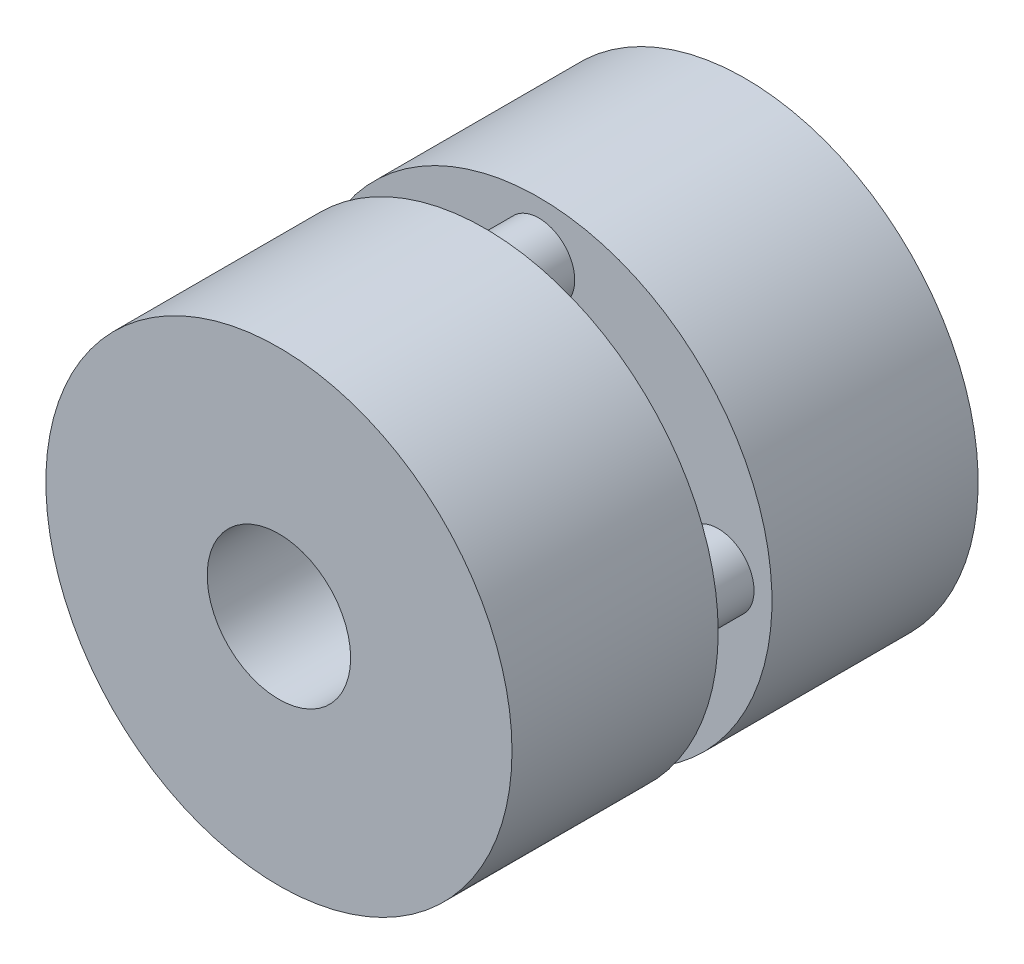
ISO-10303-21;
HEADER;
FILE_DESCRIPTION(('STEP AP214'),'2;1');
FILE_NAME('part.step','',(''),(''),'','','');
FILE_SCHEMA(('AUTOMOTIVE_DESIGN { 1 0 10303 214 1 1 1 1 }'));
ENDSEC;
DATA;
#1=APPLICATION_CONTEXT('core data for automotive mechanical design processes');
#2=APPLICATION_PROTOCOL_DEFINITION('international standard','automotive_design',2000,#1);
#3=PRODUCT_CONTEXT('',#1,'mechanical');
#4=PRODUCT('Part','Part','',(#3));
#5=PRODUCT_RELATED_PRODUCT_CATEGORY('part','',(#4));
#6=PRODUCT_DEFINITION_FORMATION('','',#4);
#7=PRODUCT_DEFINITION_CONTEXT('part definition',#1,'design');
#8=PRODUCT_DEFINITION('design','',#6,#7);
#9=PRODUCT_DEFINITION_SHAPE('','',#8);
#10=(LENGTH_UNIT() NAMED_UNIT(*) SI_UNIT(.MILLI.,.METRE.));
#11=(NAMED_UNIT(*) PLANE_ANGLE_UNIT() SI_UNIT($,.RADIAN.));
#12=(NAMED_UNIT(*) SI_UNIT($,.STERADIAN.) SOLID_ANGLE_UNIT());
#13=UNCERTAINTY_MEASURE_WITH_UNIT(LENGTH_MEASURE(1.E-05),#10,'distance_accuracy_value','');
#14=(GEOMETRIC_REPRESENTATION_CONTEXT(3) GLOBAL_UNCERTAINTY_ASSIGNED_CONTEXT((#13)) GLOBAL_UNIT_ASSIGNED_CONTEXT((#10,
#11,#12)) REPRESENTATION_CONTEXT('',''));
#15=CARTESIAN_POINT('',(0.,0.,0.));
#16=DIRECTION('',(0.,0.,1.));
#17=DIRECTION('',(1.,0.,0.));
#18=AXIS2_PLACEMENT_3D('',#15,#16,#17);
#19=CARTESIAN_POINT('',(0.,0.,11.5));
#20=DIRECTION('',(0.,0.,1.));
#21=DIRECTION('',(1.,0.,0.));
#22=AXIS2_PLACEMENT_3D('',#19,#20,#21);
#23=PLANE('',#22);
#24=CARTESIAN_POINT('',(0.,0.,11.5));
#25=DIRECTION('',(0.,0.,1.));
#26=DIRECTION('',(1.,0.,0.));
#27=AXIS2_PLACEMENT_3D('',#24,#25,#26);
#28=CIRCLE('',#27,13.);
#29=CARTESIAN_POINT('',(13.,0.,11.5));
#30=VERTEX_POINT('',#29);
#31=EDGE_CURVE('E52',#30,#30,#28,.T.);
#32=ORIENTED_EDGE('',*,*,#31,.T.);
#33=EDGE_LOOP('',(#32));
#34=FACE_BOUND('',#33,.T.);
#35=CARTESIAN_POINT('',(0.,0.,11.5));
#36=DIRECTION('',(0.,0.,1.));
#37=DIRECTION('',(1.,0.,0.));
#38=AXIS2_PLACEMENT_3D('',#35,#36,#37);
#39=CIRCLE('',#38,4.);
#40=CARTESIAN_POINT('',(4.,0.,11.5));
#41=VERTEX_POINT('',#40);
#42=EDGE_CURVE('E56',#41,#41,#39,.T.);
#43=ORIENTED_EDGE('',*,*,#42,.F.);
#44=EDGE_LOOP('',(#43));
#45=FACE_BOUND('',#44,.T.);
#46=ADVANCED_FACE('F32',(#34,#45),#23,.T.);
#47=CARTESIAN_POINT('',(0.,0.,0.));
#48=DIRECTION('',(0.,0.,1.));
#49=DIRECTION('',(1.,0.,0.));
#50=AXIS2_PLACEMENT_3D('',#47,#48,#49);
#51=PLANE('',#50);
#52=CARTESIAN_POINT('',(9.99999999999972,-2.8421709430404E-13,0.));
#53=DIRECTION('',(0.,0.,1.));
#54=DIRECTION('',(1.,0.,0.));
#55=AXIS2_PLACEMENT_3D('',#52,#53,#54);
#56=CIRCLE('',#55,2.00000000000045);
#57=CARTESIAN_POINT('',(12.0000000000002,-2.8421709430404E-13,0.));
#58=VERTEX_POINT('',#57);
#59=EDGE_CURVE('E10',#58,#58,#56,.F.);
#60=ORIENTED_EDGE('',*,*,#59,.F.);
#61=EDGE_LOOP('',(#60));
#62=FACE_BOUND('',#61,.T.);
#63=CARTESIAN_POINT('',(-5.65984895009786E-13,-10.,0.));
#64=DIRECTION('',(0.,0.,1.));
#65=DIRECTION('',(1.,0.,0.));
#66=AXIS2_PLACEMENT_3D('',#63,#64,#65);
#67=CIRCLE('',#66,2.00000000000061);
#68=CARTESIAN_POINT('',(2.00000000000004,-10.,0.));
#69=VERTEX_POINT('',#68);
#70=EDGE_CURVE('E39',#69,#69,#67,.F.);
#71=ORIENTED_EDGE('',*,*,#70,.F.);
#72=EDGE_LOOP('',(#71));
#73=FACE_BOUND('',#72,.T.);
#74=CARTESIAN_POINT('',(-10.0000000000003,2.82992447504893E-13,0.));
#75=DIRECTION('',(0.,0.,1.));
#76=DIRECTION('',(1.,0.,0.));
#77=AXIS2_PLACEMENT_3D('',#74,#75,#76);
#78=CIRCLE('',#77,2.00000000000022);
#79=CARTESIAN_POINT('',(-8.00000000000006,2.82992447504893E-13,0.));
#80=VERTEX_POINT('',#79);
#81=EDGE_CURVE('E43',#80,#80,#78,.F.);
#82=ORIENTED_EDGE('',*,*,#81,.F.);
#83=EDGE_LOOP('',(#82));
#84=FACE_BOUND('',#83,.T.);
#85=CARTESIAN_POINT('',(0.,10.,0.));
#86=DIRECTION('',(0.,0.,1.));
#87=DIRECTION('',(1.,0.,0.));
#88=AXIS2_PLACEMENT_3D('',#85,#86,#87);
#89=CIRCLE('',#88,2.);
#90=CARTESIAN_POINT('',(2.,10.,0.));
#91=VERTEX_POINT('',#90);
#92=EDGE_CURVE('E47',#91,#91,#89,.F.);
#93=ORIENTED_EDGE('',*,*,#92,.F.);
#94=EDGE_LOOP('',(#93));
#95=FACE_BOUND('',#94,.T.);
#96=CARTESIAN_POINT('',(0.,0.,0.));
#97=DIRECTION('',(0.,0.,1.));
#98=DIRECTION('',(1.,0.,0.));
#99=AXIS2_PLACEMENT_3D('',#96,#97,#98);
#100=CIRCLE('',#99,13.);
#101=CARTESIAN_POINT('',(13.,0.,0.));
#102=VERTEX_POINT('',#101);
#103=EDGE_CURVE('E53',#102,#102,#100,.T.);
#104=ORIENTED_EDGE('',*,*,#103,.F.);
#105=EDGE_LOOP('',(#104));
#106=FACE_BOUND('',#105,.T.);
#107=CARTESIAN_POINT('',(0.,0.,0.));
#108=DIRECTION('',(0.,0.,1.));
#109=DIRECTION('',(1.,0.,0.));
#110=AXIS2_PLACEMENT_3D('',#107,#108,#109);
#111=CIRCLE('',#110,4.);
#112=CARTESIAN_POINT('',(4.,0.,0.));
#113=VERTEX_POINT('',#112);
#114=EDGE_CURVE('E59',#113,#113,#111,.T.);
#115=ORIENTED_EDGE('',*,*,#114,.T.);
#116=EDGE_LOOP('',(#115));
#117=FACE_BOUND('',#116,.T.);
#118=ADVANCED_FACE('F110',(#62,#73,#84,#95,#106,#117),#51,.F.);
#119=CARTESIAN_POINT('',(0.,0.,11.5));
#120=DIRECTION('',(0.,0.,-1.));
#121=DIRECTION('',(-1.,0.,0.));
#122=AXIS2_PLACEMENT_3D('',#119,#120,#121);
#123=CYLINDRICAL_SURFACE('',#122,13.);
#124=ORIENTED_EDGE('',*,*,#31,.F.);
#125=EDGE_LOOP('',(#124));
#126=FACE_BOUND('',#125,.T.);
#127=ORIENTED_EDGE('',*,*,#103,.T.);
#128=EDGE_LOOP('',(#127));
#129=FACE_BOUND('',#128,.T.);
#130=ADVANCED_FACE('F34',(#126,#129),#123,.T.);
#131=CARTESIAN_POINT('',(0.,0.,11.5));
#132=DIRECTION('',(0.,0.,-1.));
#133=DIRECTION('',(-1.,0.,0.));
#134=AXIS2_PLACEMENT_3D('',#131,#132,#133);
#135=CYLINDRICAL_SURFACE('',#134,4.);
#136=ORIENTED_EDGE('',*,*,#42,.T.);
#137=EDGE_LOOP('',(#136));
#138=FACE_BOUND('',#137,.T.);
#139=ORIENTED_EDGE('',*,*,#114,.F.);
#140=EDGE_LOOP('',(#139));
#141=FACE_BOUND('',#140,.T.);
#142=ADVANCED_FACE('F119',(#138,#141),#135,.F.);
#143=CARTESIAN_POINT('',(0.,10.,-3.));
#144=DIRECTION('',(0.,0.,1.));
#145=DIRECTION('',(1.,0.,0.));
#146=AXIS2_PLACEMENT_3D('',#143,#144,#145);
#147=CYLINDRICAL_SURFACE('',#146,2.);
#148=CARTESIAN_POINT('',(0.,10.,-3.));
#149=DIRECTION('',(0.,0.,-1.));
#150=DIRECTION('',(-1.,0.,0.));
#151=AXIS2_PLACEMENT_3D('',#148,#149,#150);
#152=CIRCLE('',#151,2.);
#153=CARTESIAN_POINT('',(-2.,10.,-3.));
#154=VERTEX_POINT('',#153);
#155=EDGE_CURVE('E62',#154,#154,#152,.T.);
#156=ORIENTED_EDGE('',*,*,#155,.F.);
#157=EDGE_LOOP('',(#156));
#158=FACE_BOUND('',#157,.T.);
#159=ORIENTED_EDGE('',*,*,#92,.T.);
#160=EDGE_LOOP('',(#159));
#161=FACE_BOUND('',#160,.T.);
#162=ADVANCED_FACE('F122',(#158,#161),#147,.T.);
#163=CARTESIAN_POINT('',(-10.0000000000003,2.82992447504893E-13,-3.));
#164=DIRECTION('',(0.,0.,1.));
#165=DIRECTION('',(1.,0.,0.));
#166=AXIS2_PLACEMENT_3D('',#163,#164,#165);
#167=CYLINDRICAL_SURFACE('',#166,2.00000000000022);
#168=CARTESIAN_POINT('',(-10.0000000000003,2.82992447504893E-13,-3.));
#169=DIRECTION('',(0.,0.,-1.));
#170=DIRECTION('',(-1.,0.,0.));
#171=AXIS2_PLACEMENT_3D('',#168,#169,#170);
#172=CIRCLE('',#171,2.00000000000022);
#173=CARTESIAN_POINT('',(-12.0000000000005,2.82992447504893E-13,-3.));
#174=VERTEX_POINT('',#173);
#175=EDGE_CURVE('E67',#174,#174,#172,.T.);
#176=ORIENTED_EDGE('',*,*,#175,.F.);
#177=EDGE_LOOP('',(#176));
#178=FACE_BOUND('',#177,.T.);
#179=ORIENTED_EDGE('',*,*,#81,.T.);
#180=EDGE_LOOP('',(#179));
#181=FACE_BOUND('',#180,.T.);
#182=ADVANCED_FACE('F126',(#178,#181),#167,.T.);
#183=CARTESIAN_POINT('',(-5.65984895009786E-13,-10.,-3.));
#184=DIRECTION('',(0.,0.,1.));
#185=DIRECTION('',(1.,0.,0.));
#186=AXIS2_PLACEMENT_3D('',#183,#184,#185);
#187=CYLINDRICAL_SURFACE('',#186,2.00000000000061);
#188=CARTESIAN_POINT('',(-5.65984895009786E-13,-10.,-3.));
#189=DIRECTION('',(0.,0.,-1.));
#190=DIRECTION('',(-1.,0.,0.));
#191=AXIS2_PLACEMENT_3D('',#188,#189,#190);
#192=CIRCLE('',#191,2.00000000000061);
#193=CARTESIAN_POINT('',(-2.00000000000117,-10.,-3.));
#194=VERTEX_POINT('',#193);
#195=EDGE_CURVE('E70',#194,#194,#192,.T.);
#196=ORIENTED_EDGE('',*,*,#195,.F.);
#197=EDGE_LOOP('',(#196));
#198=FACE_BOUND('',#197,.T.);
#199=ORIENTED_EDGE('',*,*,#70,.T.);
#200=EDGE_LOOP('',(#199));
#201=FACE_BOUND('',#200,.T.);
#202=ADVANCED_FACE('F105',(#198,#201),#187,.T.);
#203=CARTESIAN_POINT('',(9.99999999999972,-2.8421709430404E-13,-3.));
#204=DIRECTION('',(0.,0.,1.));
#205=DIRECTION('',(1.,0.,0.));
#206=AXIS2_PLACEMENT_3D('',#203,#204,#205);
#207=CYLINDRICAL_SURFACE('',#206,2.00000000000045);
#208=CARTESIAN_POINT('',(9.99999999999972,-2.8421709430404E-13,-3.));
#209=DIRECTION('',(0.,0.,-1.));
#210=DIRECTION('',(-1.,0.,0.));
#211=AXIS2_PLACEMENT_3D('',#208,#209,#210);
#212=CIRCLE('',#211,2.00000000000045);
#213=CARTESIAN_POINT('',(7.99999999999926,-2.8421709430404E-13,-3.));
#214=VERTEX_POINT('',#213);
#215=EDGE_CURVE('E73',#214,#214,#212,.T.);
#216=ORIENTED_EDGE('',*,*,#215,.F.);
#217=EDGE_LOOP('',(#216));
#218=FACE_BOUND('',#217,.T.);
#219=ORIENTED_EDGE('',*,*,#59,.T.);
#220=EDGE_LOOP('',(#219));
#221=FACE_BOUND('',#220,.T.);
#222=ADVANCED_FACE('F95',(#218,#221),#207,.T.);
#223=CARTESIAN_POINT('',(0.,0.,-14.5));
#224=DIRECTION('',(0.,0.,-1.));
#225=DIRECTION('',(-1.,0.,0.));
#226=AXIS2_PLACEMENT_3D('',#223,#224,#225);
#227=PLANE('',#226);
#228=CARTESIAN_POINT('',(0.,0.,-14.5));
#229=DIRECTION('',(0.,0.,-1.));
#230=DIRECTION('',(-1.,0.,0.));
#231=AXIS2_PLACEMENT_3D('',#228,#229,#230);
#232=CIRCLE('',#231,13.);
#233=CARTESIAN_POINT('',(-13.,0.,-14.5));
#234=VERTEX_POINT('',#233);
#235=EDGE_CURVE('E76',#234,#234,#232,.T.);
#236=ORIENTED_EDGE('',*,*,#235,.T.);
#237=EDGE_LOOP('',(#236));
#238=FACE_BOUND('',#237,.T.);
#239=CARTESIAN_POINT('',(0.,0.,-14.5));
#240=DIRECTION('',(0.,0.,-1.));
#241=DIRECTION('',(-1.,0.,0.));
#242=AXIS2_PLACEMENT_3D('',#239,#240,#241);
#243=CIRCLE('',#242,4.);
#244=CARTESIAN_POINT('',(-4.,0.,-14.5));
#245=VERTEX_POINT('',#244);
#246=EDGE_CURVE('E80',#245,#245,#243,.T.);
#247=ORIENTED_EDGE('',*,*,#246,.F.);
#248=EDGE_LOOP('',(#247));
#249=FACE_BOUND('',#248,.T.);
#250=ADVANCED_FACE('F92',(#238,#249),#227,.T.);
#251=CARTESIAN_POINT('',(0.,0.,-3.));
#252=DIRECTION('',(0.,0.,-1.));
#253=DIRECTION('',(-1.,0.,0.));
#254=AXIS2_PLACEMENT_3D('',#251,#252,#253);
#255=PLANE('',#254);
#256=ORIENTED_EDGE('',*,*,#155,.T.);
#257=EDGE_LOOP('',(#256));
#258=FACE_BOUND('',#257,.T.);
#259=ORIENTED_EDGE('',*,*,#175,.T.);
#260=EDGE_LOOP('',(#259));
#261=FACE_BOUND('',#260,.T.);
#262=ORIENTED_EDGE('',*,*,#195,.T.);
#263=EDGE_LOOP('',(#262));
#264=FACE_BOUND('',#263,.T.);
#265=ORIENTED_EDGE('',*,*,#215,.T.);
#266=EDGE_LOOP('',(#265));
#267=FACE_BOUND('',#266,.T.);
#268=CARTESIAN_POINT('',(0.,0.,-3.));
#269=DIRECTION('',(0.,0.,-1.));
#270=DIRECTION('',(-1.,0.,0.));
#271=AXIS2_PLACEMENT_3D('',#268,#269,#270);
#272=CIRCLE('',#271,13.);
#273=CARTESIAN_POINT('',(-13.,0.,-3.));
#274=VERTEX_POINT('',#273);
#275=EDGE_CURVE('E77',#274,#274,#272,.T.);
#276=ORIENTED_EDGE('',*,*,#275,.F.);
#277=EDGE_LOOP('',(#276));
#278=FACE_BOUND('',#277,.T.);
#279=CARTESIAN_POINT('',(0.,0.,-3.));
#280=DIRECTION('',(0.,0.,-1.));
#281=DIRECTION('',(-1.,0.,0.));
#282=AXIS2_PLACEMENT_3D('',#279,#280,#281);
#283=CIRCLE('',#282,4.);
#284=CARTESIAN_POINT('',(-4.,0.,-3.));
#285=VERTEX_POINT('',#284);
#286=EDGE_CURVE('E83',#285,#285,#283,.T.);
#287=ORIENTED_EDGE('',*,*,#286,.T.);
#288=EDGE_LOOP('',(#287));
#289=FACE_BOUND('',#288,.T.);
#290=ADVANCED_FACE('F94',(#258,#261,#264,#267,#278,#289),#255,.F.);
#291=CARTESIAN_POINT('',(0.,0.,-14.5));
#292=DIRECTION('',(0.,0.,1.));
#293=DIRECTION('',(1.,0.,0.));
#294=AXIS2_PLACEMENT_3D('',#291,#292,#293);
#295=CYLINDRICAL_SURFACE('',#294,13.);
#296=ORIENTED_EDGE('',*,*,#235,.F.);
#297=EDGE_LOOP('',(#296));
#298=FACE_BOUND('',#297,.T.);
#299=ORIENTED_EDGE('',*,*,#275,.T.);
#300=EDGE_LOOP('',(#299));
#301=FACE_BOUND('',#300,.T.);
#302=ADVANCED_FACE('F102',(#298,#301),#295,.T.);
#303=CARTESIAN_POINT('',(0.,0.,-14.5));
#304=DIRECTION('',(0.,0.,1.));
#305=DIRECTION('',(1.,0.,0.));
#306=AXIS2_PLACEMENT_3D('',#303,#304,#305);
#307=CYLINDRICAL_SURFACE('',#306,4.);
#308=ORIENTED_EDGE('',*,*,#246,.T.);
#309=EDGE_LOOP('',(#308));
#310=FACE_BOUND('',#309,.T.);
#311=ORIENTED_EDGE('',*,*,#286,.F.);
#312=EDGE_LOOP('',(#311));
#313=FACE_BOUND('',#312,.T.);
#314=ADVANCED_FACE('F89',(#310,#313),#307,.F.);
#315=CLOSED_SHELL('',(#46,#118,#130,#142,#162,#182,#202,#222,#250,#290,#302,#314));
#316=MANIFOLD_SOLID_BREP('B2',#315);
#317=ADVANCED_BREP_SHAPE_REPRESENTATION('',(#18,#316),#14);
#318=SHAPE_DEFINITION_REPRESENTATION(#9,#317);
ENDSEC;
END-ISO-10303-21;
